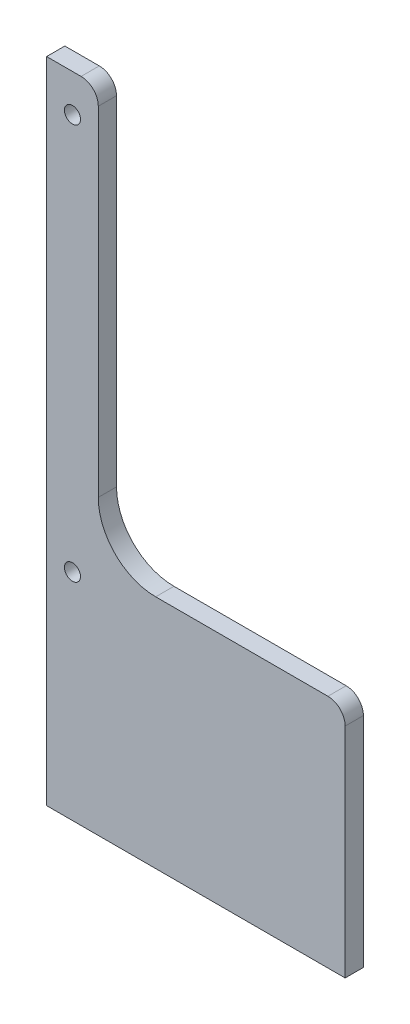
ISO-10303-21;
HEADER;
FILE_DESCRIPTION(('STEP AP214'),'2;1');
FILE_NAME('part.step','',(''),(''),'','','');
FILE_SCHEMA(('AUTOMOTIVE_DESIGN { 1 0 10303 214 1 1 1 1 }'));
ENDSEC;
DATA;
#1=APPLICATION_CONTEXT('core data for automotive mechanical design processes');
#2=APPLICATION_PROTOCOL_DEFINITION('international standard','automotive_design',2000,#1);
#3=PRODUCT_CONTEXT('',#1,'mechanical');
#4=PRODUCT('Part','Part','',(#3));
#5=PRODUCT_RELATED_PRODUCT_CATEGORY('part','',(#4));
#6=PRODUCT_DEFINITION_FORMATION('','',#4);
#7=PRODUCT_DEFINITION_CONTEXT('part definition',#1,'design');
#8=PRODUCT_DEFINITION('design','',#6,#7);
#9=PRODUCT_DEFINITION_SHAPE('','',#8);
#10=(LENGTH_UNIT() NAMED_UNIT(*) SI_UNIT(.MILLI.,.METRE.));
#11=(NAMED_UNIT(*) PLANE_ANGLE_UNIT() SI_UNIT($,.RADIAN.));
#12=(NAMED_UNIT(*) SI_UNIT($,.STERADIAN.) SOLID_ANGLE_UNIT());
#13=UNCERTAINTY_MEASURE_WITH_UNIT(LENGTH_MEASURE(1.E-05),#10,'distance_accuracy_value','');
#14=(GEOMETRIC_REPRESENTATION_CONTEXT(3) GLOBAL_UNCERTAINTY_ASSIGNED_CONTEXT((#13)) GLOBAL_UNIT_ASSIGNED_CONTEXT((#10,
#11,#12)) REPRESENTATION_CONTEXT('',''));
#15=CARTESIAN_POINT('',(0.,0.,0.));
#16=DIRECTION('',(0.,0.,1.));
#17=DIRECTION('',(1.,0.,0.));
#18=AXIS2_PLACEMENT_3D('',#15,#16,#17);
#19=CARTESIAN_POINT('',(0.,81.,3.175));
#20=DIRECTION('',(0.,1.,0.));
#21=DIRECTION('',(0.,0.,1.));
#22=AXIS2_PLACEMENT_3D('',#19,#20,#21);
#23=PLANE('',#22);
#24=DIRECTION('',(1.,0.,0.));
#25=VECTOR('',#24,1.);
#26=CARTESIAN_POINT('',(0.,81.,3.175));
#27=LINE('',#26,#25);
#28=CARTESIAN_POINT('',(0.,81.,3.175));
#29=VERTEX_POINT('',#28);
#30=CARTESIAN_POINT('',(5.99999999999999,81.,3.175));
#31=VERTEX_POINT('',#30);
#32=EDGE_CURVE('E111',#29,#31,#27,.T.);
#33=ORIENTED_EDGE('',*,*,#32,.T.);
#34=DIRECTION('',(0.,0.,-1.));
#35=VECTOR('',#34,1.);
#36=CARTESIAN_POINT('',(5.99999999999999,81.,3.175));
#37=LINE('',#36,#35);
#38=CARTESIAN_POINT('',(5.99999999999999,81.,0.));
#39=VERTEX_POINT('',#38);
#40=EDGE_CURVE('E177',#31,#39,#37,.T.);
#41=ORIENTED_EDGE('',*,*,#40,.T.);
#42=DIRECTION('',(1.,0.,0.));
#43=VECTOR('',#42,1.);
#44=CARTESIAN_POINT('',(0.,81.,0.));
#45=LINE('',#44,#43);
#46=CARTESIAN_POINT('',(0.,81.,0.));
#47=VERTEX_POINT('',#46);
#48=EDGE_CURVE('E114',#47,#39,#45,.T.);
#49=ORIENTED_EDGE('',*,*,#48,.F.);
#50=DIRECTION('',(0.,0.,-1.));
#51=VECTOR('',#50,1.);
#52=CARTESIAN_POINT('',(0.,81.,3.175));
#53=LINE('',#52,#51);
#54=EDGE_CURVE('E107',#29,#47,#53,.T.);
#55=ORIENTED_EDGE('',*,*,#54,.F.);
#56=EDGE_LOOP('',(#33,#41,#49,#55));
#57=FACE_BOUND('',#56,.T.);
#58=ADVANCED_FACE('F35',(#57),#23,.T.);
#59=CARTESIAN_POINT('',(0.,0.,3.175));
#60=DIRECTION('',(1.,0.,0.));
#61=DIRECTION('',(0.,1.,0.));
#62=AXIS2_PLACEMENT_3D('',#59,#60,#61);
#63=PLANE('',#62);
#64=DIRECTION('',(0.,-1.,0.));
#65=VECTOR('',#64,1.);
#66=CARTESIAN_POINT('',(0.,0.,0.));
#67=LINE('',#66,#65);
#68=CARTESIAN_POINT('',(0.,-32.,0.));
#69=VERTEX_POINT('',#68);
#70=EDGE_CURVE('E154',#47,#69,#67,.T.);
#71=ORIENTED_EDGE('',*,*,#70,.T.);
#72=DIRECTION('',(0.,0.,-1.));
#73=VECTOR('',#72,1.);
#74=CARTESIAN_POINT('',(0.,-32.,3.175));
#75=LINE('',#74,#73);
#76=CARTESIAN_POINT('',(0.,-32.,3.175));
#77=VERTEX_POINT('',#76);
#78=EDGE_CURVE('E119',#77,#69,#75,.T.);
#79=ORIENTED_EDGE('',*,*,#78,.F.);
#80=DIRECTION('',(0.,-1.,0.));
#81=VECTOR('',#80,1.);
#82=CARTESIAN_POINT('',(0.,0.,3.175));
#83=LINE('',#82,#81);
#84=EDGE_CURVE('E122',#29,#77,#83,.T.);
#85=ORIENTED_EDGE('',*,*,#84,.F.);
#86=ORIENTED_EDGE('',*,*,#54,.T.);
#87=EDGE_LOOP('',(#71,#79,#85,#86));
#88=FACE_BOUND('',#87,.T.);
#89=ADVANCED_FACE('F123',(#88),#63,.F.);
#90=CARTESIAN_POINT('',(0.,-32.,3.175));
#91=DIRECTION('',(0.,-1.,0.));
#92=DIRECTION('',(1.,0.,0.));
#93=AXIS2_PLACEMENT_3D('',#90,#91,#92);
#94=PLANE('',#93);
#95=DIRECTION('',(-1.,0.,0.));
#96=VECTOR('',#95,1.);
#97=CARTESIAN_POINT('',(0.,-32.,0.));
#98=LINE('',#97,#96);
#99=CARTESIAN_POINT('',(52.,-32.,0.));
#100=VERTEX_POINT('',#99);
#101=EDGE_CURVE('E156',#100,#69,#98,.T.);
#102=ORIENTED_EDGE('',*,*,#101,.F.);
#103=DIRECTION('',(0.,0.,-1.));
#104=VECTOR('',#103,1.);
#105=CARTESIAN_POINT('',(52.,-32.,3.175));
#106=LINE('',#105,#104);
#107=CARTESIAN_POINT('',(52.,-32.,3.175));
#108=VERTEX_POINT('',#107);
#109=EDGE_CURVE('E146',#108,#100,#106,.T.);
#110=ORIENTED_EDGE('',*,*,#109,.F.);
#111=DIRECTION('',(-1.,0.,0.));
#112=VECTOR('',#111,1.);
#113=CARTESIAN_POINT('',(0.,-32.,3.175));
#114=LINE('',#113,#112);
#115=EDGE_CURVE('E126',#108,#77,#114,.T.);
#116=ORIENTED_EDGE('',*,*,#115,.T.);
#117=ORIENTED_EDGE('',*,*,#78,.T.);
#118=EDGE_LOOP('',(#102,#110,#116,#117));
#119=FACE_BOUND('',#118,.T.);
#120=ADVANCED_FACE('F209',(#119),#94,.T.);
#121=CARTESIAN_POINT('',(52.,0.,3.175));
#122=DIRECTION('',(-1.,0.,0.));
#123=DIRECTION('',(0.,0.,1.));
#124=AXIS2_PLACEMENT_3D('',#121,#122,#123);
#125=PLANE('',#124);
#126=DIRECTION('',(0.,1.,0.));
#127=VECTOR('',#126,1.);
#128=CARTESIAN_POINT('',(52.,0.,0.));
#129=LINE('',#128,#127);
#130=CARTESIAN_POINT('',(52.,6.,0.));
#131=VERTEX_POINT('',#130);
#132=EDGE_CURVE('E159',#100,#131,#129,.T.);
#133=ORIENTED_EDGE('',*,*,#132,.T.);
#134=DIRECTION('',(0.,0.,-1.));
#135=VECTOR('',#134,1.);
#136=CARTESIAN_POINT('',(52.,6.,3.175));
#137=LINE('',#136,#135);
#138=CARTESIAN_POINT('',(52.,6.,3.175));
#139=VERTEX_POINT('',#138);
#140=EDGE_CURVE('E11',#131,#139,#137,.F.);
#141=ORIENTED_EDGE('',*,*,#140,.T.);
#142=DIRECTION('',(0.,1.,0.));
#143=VECTOR('',#142,1.);
#144=CARTESIAN_POINT('',(52.,0.,3.175));
#145=LINE('',#144,#143);
#146=EDGE_CURVE('E140',#108,#139,#145,.T.);
#147=ORIENTED_EDGE('',*,*,#146,.F.);
#148=ORIENTED_EDGE('',*,*,#109,.T.);
#149=EDGE_LOOP('',(#133,#141,#147,#148));
#150=FACE_BOUND('',#149,.T.);
#151=ADVANCED_FACE('F247',(#150),#125,.F.);
#152=CARTESIAN_POINT('',(0.,9.,3.175));
#153=DIRECTION('',(0.,1.,0.));
#154=DIRECTION('',(0.,0.,1.));
#155=AXIS2_PLACEMENT_3D('',#152,#153,#154);
#156=PLANE('',#155);
#157=DIRECTION('',(1.,0.,0.));
#158=VECTOR('',#157,1.);
#159=CARTESIAN_POINT('',(0.,9.,3.175));
#160=LINE('',#159,#158);
#161=CARTESIAN_POINT('',(19.,9.,3.175));
#162=VERTEX_POINT('',#161);
#163=CARTESIAN_POINT('',(49.,9.,3.175));
#164=VERTEX_POINT('',#163);
#165=EDGE_CURVE('E142',#162,#164,#160,.T.);
#166=ORIENTED_EDGE('',*,*,#165,.T.);
#167=DIRECTION('',(0.,0.,-1.));
#168=VECTOR('',#167,1.);
#169=CARTESIAN_POINT('',(49.,9.,0.));
#170=LINE('',#169,#168);
#171=CARTESIAN_POINT('',(49.,9.,0.));
#172=VERTEX_POINT('',#171);
#173=EDGE_CURVE('E43',#164,#172,#170,.T.);
#174=ORIENTED_EDGE('',*,*,#173,.T.);
#175=DIRECTION('',(1.,0.,0.));
#176=VECTOR('',#175,1.);
#177=CARTESIAN_POINT('',(0.,9.,0.));
#178=LINE('',#177,#176);
#179=CARTESIAN_POINT('',(19.,9.,0.));
#180=VERTEX_POINT('',#179);
#181=EDGE_CURVE('E161',#180,#172,#178,.T.);
#182=ORIENTED_EDGE('',*,*,#181,.F.);
#183=DIRECTION('',(0.,0.,-1.));
#184=VECTOR('',#183,1.);
#185=CARTESIAN_POINT('',(19.,9.,3.175));
#186=LINE('',#185,#184);
#187=EDGE_CURVE('E170',#180,#162,#186,.F.);
#188=ORIENTED_EDGE('',*,*,#187,.T.);
#189=EDGE_LOOP('',(#166,#174,#182,#188));
#190=FACE_BOUND('',#189,.T.);
#191=ADVANCED_FACE('F190',(#190),#156,.T.);
#192=CARTESIAN_POINT('',(4.50000000000001,5.5,3.175));
#193=DIRECTION('',(0.,0.,-1.));
#194=DIRECTION('',(-1.,0.,0.));
#195=AXIS2_PLACEMENT_3D('',#192,#193,#194);
#196=CYLINDRICAL_SURFACE('',#195,1.4);
#197=CARTESIAN_POINT('',(4.50000000000001,5.5,3.175));
#198=DIRECTION('',(0.,0.,1.));
#199=DIRECTION('',(1.,0.,0.));
#200=AXIS2_PLACEMENT_3D('',#197,#198,#199);
#201=CIRCLE('',#200,1.4);
#202=CARTESIAN_POINT('',(5.90000000000001,5.5,3.175));
#203=VERTEX_POINT('',#202);
#204=EDGE_CURVE('E132',#203,#203,#201,.T.);
#205=ORIENTED_EDGE('',*,*,#204,.T.);
#206=EDGE_LOOP('',(#205));
#207=FACE_BOUND('',#206,.T.);
#208=CARTESIAN_POINT('',(4.50000000000001,5.5,0.));
#209=DIRECTION('',(0.,0.,1.));
#210=DIRECTION('',(1.,0.,0.));
#211=AXIS2_PLACEMENT_3D('',#208,#209,#210);
#212=CIRCLE('',#211,1.4);
#213=CARTESIAN_POINT('',(5.90000000000001,5.5,0.));
#214=VERTEX_POINT('',#213);
#215=EDGE_CURVE('E150',#214,#214,#212,.T.);
#216=ORIENTED_EDGE('',*,*,#215,.F.);
#217=EDGE_LOOP('',(#216));
#218=FACE_BOUND('',#217,.T.);
#219=ADVANCED_FACE('F222',(#207,#218),#196,.F.);
#220=CARTESIAN_POINT('',(4.49999999999999,74.47,3.175));
#221=DIRECTION('',(0.,0.,-1.));
#222=DIRECTION('',(-1.,0.,0.));
#223=AXIS2_PLACEMENT_3D('',#220,#221,#222);
#224=CYLINDRICAL_SURFACE('',#223,1.4);
#225=CARTESIAN_POINT('',(4.49999999999999,74.47,3.175));
#226=DIRECTION('',(0.,0.,1.));
#227=DIRECTION('',(1.,0.,0.));
#228=AXIS2_PLACEMENT_3D('',#225,#226,#227);
#229=CIRCLE('',#228,1.4);
#230=CARTESIAN_POINT('',(5.89999999999999,74.47,3.175));
#231=VERTEX_POINT('',#230);
#232=EDGE_CURVE('E135',#231,#231,#229,.T.);
#233=ORIENTED_EDGE('',*,*,#232,.T.);
#234=EDGE_LOOP('',(#233));
#235=FACE_BOUND('',#234,.T.);
#236=CARTESIAN_POINT('',(4.49999999999999,74.47,0.));
#237=DIRECTION('',(0.,0.,1.));
#238=DIRECTION('',(1.,0.,0.));
#239=AXIS2_PLACEMENT_3D('',#236,#237,#238);
#240=CIRCLE('',#239,1.4);
#241=CARTESIAN_POINT('',(5.89999999999999,74.47,0.));
#242=VERTEX_POINT('',#241);
#243=EDGE_CURVE('E147',#242,#242,#240,.T.);
#244=ORIENTED_EDGE('',*,*,#243,.F.);
#245=EDGE_LOOP('',(#244));
#246=FACE_BOUND('',#245,.T.);
#247=ADVANCED_FACE('F225',(#235,#246),#224,.F.);
#248=CARTESIAN_POINT('',(9.00000000000001,0.,3.175));
#249=DIRECTION('',(1.,0.,0.));
#250=DIRECTION('',(0.,1.,0.));
#251=AXIS2_PLACEMENT_3D('',#248,#249,#250);
#252=PLANE('',#251);
#253=DIRECTION('',(0.,-1.,0.));
#254=VECTOR('',#253,1.);
#255=CARTESIAN_POINT('',(9.00000000000001,0.,0.));
#256=LINE('',#255,#254);
#257=CARTESIAN_POINT('',(8.99999999999999,78.,0.));
#258=VERTEX_POINT('',#257);
#259=CARTESIAN_POINT('',(9.,19.,0.));
#260=VERTEX_POINT('',#259);
#261=EDGE_CURVE('E164',#258,#260,#256,.T.);
#262=ORIENTED_EDGE('',*,*,#261,.F.);
#263=DIRECTION('',(0.,0.,-1.));
#264=VECTOR('',#263,1.);
#265=CARTESIAN_POINT('',(8.99999999999999,78.,3.175));
#266=LINE('',#265,#264);
#267=CARTESIAN_POINT('',(8.99999999999999,78.,3.175));
#268=VERTEX_POINT('',#267);
#269=EDGE_CURVE('E183',#258,#268,#266,.F.);
#270=ORIENTED_EDGE('',*,*,#269,.T.);
#271=DIRECTION('',(0.,-1.,0.));
#272=VECTOR('',#271,1.);
#273=CARTESIAN_POINT('',(9.00000000000001,0.,3.175));
#274=LINE('',#273,#272);
#275=CARTESIAN_POINT('',(9.,19.,3.175));
#276=VERTEX_POINT('',#275);
#277=EDGE_CURVE('E144',#268,#276,#274,.T.);
#278=ORIENTED_EDGE('',*,*,#277,.T.);
#279=DIRECTION('',(0.,0.,-1.));
#280=VECTOR('',#279,1.);
#281=CARTESIAN_POINT('',(9.,19.,0.));
#282=LINE('',#281,#280);
#283=EDGE_CURVE('E118',#276,#260,#282,.T.);
#284=ORIENTED_EDGE('',*,*,#283,.T.);
#285=EDGE_LOOP('',(#262,#270,#278,#284));
#286=FACE_BOUND('',#285,.T.);
#287=ADVANCED_FACE('F203',(#286),#252,.T.);
#288=CARTESIAN_POINT('',(0.,0.,3.175));
#289=DIRECTION('',(0.,0.,1.));
#290=DIRECTION('',(1.,0.,0.));
#291=AXIS2_PLACEMENT_3D('',#288,#289,#290);
#292=PLANE('',#291);
#293=ORIENTED_EDGE('',*,*,#232,.F.);
#294=EDGE_LOOP('',(#293));
#295=FACE_BOUND('',#294,.T.);
#296=ORIENTED_EDGE('',*,*,#204,.F.);
#297=EDGE_LOOP('',(#296));
#298=FACE_BOUND('',#297,.T.);
#299=ORIENTED_EDGE('',*,*,#277,.F.);
#300=CARTESIAN_POINT('',(5.99999999999999,78.,3.175));
#301=DIRECTION('',(0.,0.,1.));
#302=DIRECTION('',(1.,0.,0.));
#303=AXIS2_PLACEMENT_3D('',#300,#301,#302);
#304=CIRCLE('',#303,3.);
#305=EDGE_CURVE('E131',#268,#31,#304,.T.);
#306=ORIENTED_EDGE('',*,*,#305,.T.);
#307=ORIENTED_EDGE('',*,*,#32,.F.);
#308=ORIENTED_EDGE('',*,*,#84,.T.);
#309=ORIENTED_EDGE('',*,*,#115,.F.);
#310=ORIENTED_EDGE('',*,*,#146,.T.);
#311=CARTESIAN_POINT('',(49.,6.,3.175));
#312=DIRECTION('',(0.,0.,1.));
#313=DIRECTION('',(1.,0.,0.));
#314=AXIS2_PLACEMENT_3D('',#311,#312,#313);
#315=CIRCLE('',#314,3.);
#316=EDGE_CURVE('E50',#139,#164,#315,.T.);
#317=ORIENTED_EDGE('',*,*,#316,.T.);
#318=ORIENTED_EDGE('',*,*,#165,.F.);
#319=CARTESIAN_POINT('',(19.,19.,3.175));
#320=DIRECTION('',(0.,0.,1.));
#321=DIRECTION('',(1.,0.,0.));
#322=AXIS2_PLACEMENT_3D('',#319,#320,#321);
#323=CIRCLE('',#322,10.);
#324=EDGE_CURVE('E174',#162,#276,#323,.F.);
#325=ORIENTED_EDGE('',*,*,#324,.T.);
#326=EDGE_LOOP('',(#299,#306,#307,#308,#309,#310,#317,#318,#325));
#327=FACE_BOUND('',#326,.T.);
#328=ADVANCED_FACE('F129',(#295,#298,#327),#292,.T.);
#329=CARTESIAN_POINT('',(0.,0.,0.));
#330=DIRECTION('',(0.,0.,1.));
#331=DIRECTION('',(1.,0.,0.));
#332=AXIS2_PLACEMENT_3D('',#329,#330,#331);
#333=PLANE('',#332);
#334=ORIENTED_EDGE('',*,*,#243,.T.);
#335=EDGE_LOOP('',(#334));
#336=FACE_BOUND('',#335,.T.);
#337=ORIENTED_EDGE('',*,*,#215,.T.);
#338=EDGE_LOOP('',(#337));
#339=FACE_BOUND('',#338,.T.);
#340=ORIENTED_EDGE('',*,*,#48,.T.);
#341=CARTESIAN_POINT('',(5.99999999999999,78.,0.));
#342=DIRECTION('',(0.,0.,1.));
#343=DIRECTION('',(1.,0.,0.));
#344=AXIS2_PLACEMENT_3D('',#341,#342,#343);
#345=CIRCLE('',#344,3.);
#346=EDGE_CURVE('E181',#39,#258,#345,.F.);
#347=ORIENTED_EDGE('',*,*,#346,.T.);
#348=ORIENTED_EDGE('',*,*,#261,.T.);
#349=CARTESIAN_POINT('',(19.,19.,0.));
#350=DIRECTION('',(0.,0.,1.));
#351=DIRECTION('',(1.,0.,0.));
#352=AXIS2_PLACEMENT_3D('',#349,#350,#351);
#353=CIRCLE('',#352,10.);
#354=EDGE_CURVE('E172',#260,#180,#353,.T.);
#355=ORIENTED_EDGE('',*,*,#354,.T.);
#356=ORIENTED_EDGE('',*,*,#181,.T.);
#357=CARTESIAN_POINT('',(49.,6.,0.));
#358=DIRECTION('',(0.,0.,1.));
#359=DIRECTION('',(1.,0.,0.));
#360=AXIS2_PLACEMENT_3D('',#357,#358,#359);
#361=CIRCLE('',#360,3.);
#362=EDGE_CURVE('E179',#172,#131,#361,.F.);
#363=ORIENTED_EDGE('',*,*,#362,.T.);
#364=ORIENTED_EDGE('',*,*,#132,.F.);
#365=ORIENTED_EDGE('',*,*,#101,.T.);
#366=ORIENTED_EDGE('',*,*,#70,.F.);
#367=EDGE_LOOP('',(#340,#347,#348,#355,#356,#363,#364,#365,#366));
#368=FACE_BOUND('',#367,.T.);
#369=ADVANCED_FACE('F194',(#336,#339,#368),#333,.F.);
#370=CARTESIAN_POINT('',(19.,19.,3.175));
#371=DIRECTION('',(0.,0.,1.));
#372=DIRECTION('',(1.,0.,0.));
#373=AXIS2_PLACEMENT_3D('',#370,#371,#372);
#374=CYLINDRICAL_SURFACE('',#373,10.);
#375=ORIENTED_EDGE('',*,*,#324,.F.);
#376=ORIENTED_EDGE('',*,*,#187,.F.);
#377=ORIENTED_EDGE('',*,*,#354,.F.);
#378=ORIENTED_EDGE('',*,*,#283,.F.);
#379=EDGE_LOOP('',(#375,#376,#377,#378));
#380=FACE_BOUND('',#379,.T.);
#381=ADVANCED_FACE('F201',(#380),#374,.F.);
#382=CARTESIAN_POINT('',(5.99999999999999,78.,3.175));
#383=DIRECTION('',(0.,0.,-1.));
#384=DIRECTION('',(-1.,0.,0.));
#385=AXIS2_PLACEMENT_3D('',#382,#383,#384);
#386=CYLINDRICAL_SURFACE('',#385,3.);
#387=ORIENTED_EDGE('',*,*,#305,.F.);
#388=ORIENTED_EDGE('',*,*,#269,.F.);
#389=ORIENTED_EDGE('',*,*,#346,.F.);
#390=ORIENTED_EDGE('',*,*,#40,.F.);
#391=EDGE_LOOP('',(#387,#388,#389,#390));
#392=FACE_BOUND('',#391,.T.);
#393=ADVANCED_FACE('F206',(#392),#386,.T.);
#394=CARTESIAN_POINT('',(49.,6.,3.175));
#395=DIRECTION('',(0.,0.,1.));
#396=DIRECTION('',(1.,0.,0.));
#397=AXIS2_PLACEMENT_3D('',#394,#395,#396);
#398=CYLINDRICAL_SURFACE('',#397,3.);
#399=ORIENTED_EDGE('',*,*,#316,.F.);
#400=ORIENTED_EDGE('',*,*,#140,.F.);
#401=ORIENTED_EDGE('',*,*,#362,.F.);
#402=ORIENTED_EDGE('',*,*,#173,.F.);
#403=EDGE_LOOP('',(#399,#400,#401,#402));
#404=FACE_BOUND('',#403,.T.);
#405=ADVANCED_FACE('F37',(#404),#398,.T.);
#406=CLOSED_SHELL('',(#58,#89,#120,#151,#191,#219,#247,#287,#328,#369,#381,#393,#405));
#407=MANIFOLD_SOLID_BREP('B2',#406);
#408=ADVANCED_BREP_SHAPE_REPRESENTATION('',(#18,#407),#14);
#409=SHAPE_DEFINITION_REPRESENTATION(#9,#408);
ENDSEC;
END-ISO-10303-21;
